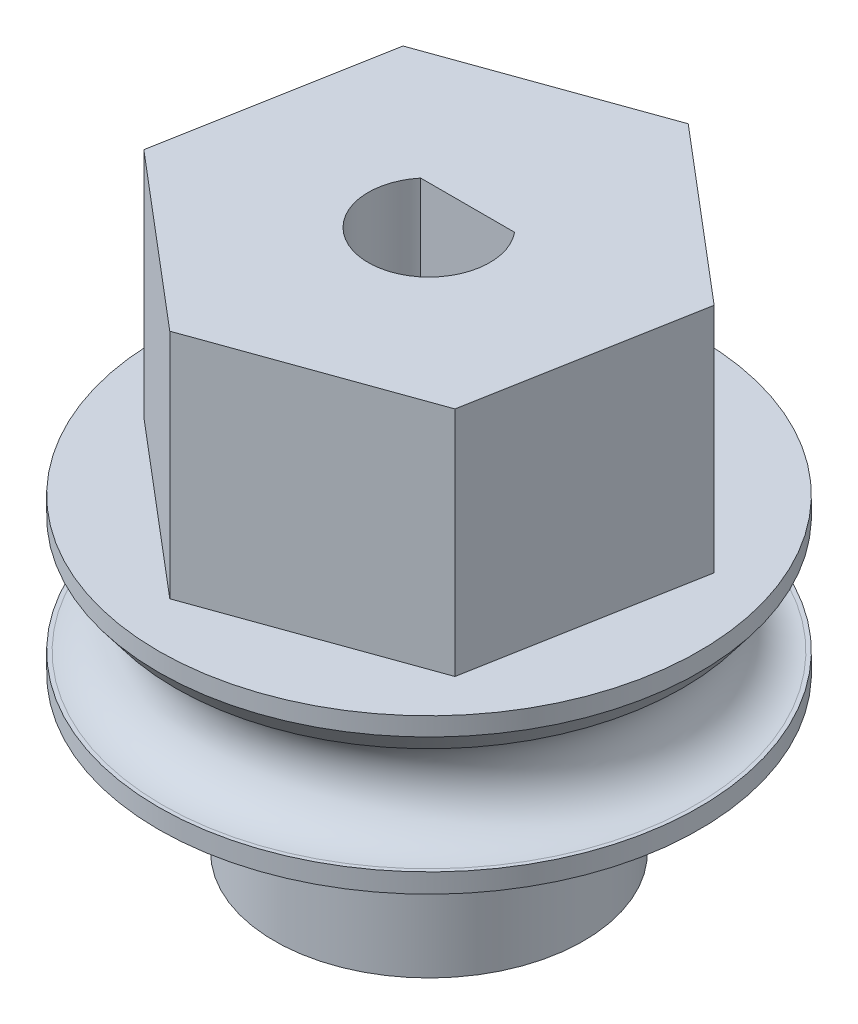
ISO-10303-21;
HEADER;
FILE_DESCRIPTION(('STEP AP214'),'2;1');
FILE_NAME('part.step','',(''),(''),'','','');
FILE_SCHEMA(('AUTOMOTIVE_DESIGN { 1 0 10303 214 1 1 1 1 }'));
ENDSEC;
DATA;
#1=APPLICATION_CONTEXT('core data for automotive mechanical design processes');
#2=APPLICATION_PROTOCOL_DEFINITION('international standard','automotive_design',2000,#1);
#3=PRODUCT_CONTEXT('',#1,'mechanical');
#4=PRODUCT('Part','Part','',(#3));
#5=PRODUCT_RELATED_PRODUCT_CATEGORY('part','',(#4));
#6=PRODUCT_DEFINITION_FORMATION('','',#4);
#7=PRODUCT_DEFINITION_CONTEXT('part definition',#1,'design');
#8=PRODUCT_DEFINITION('design','',#6,#7);
#9=PRODUCT_DEFINITION_SHAPE('','',#8);
#10=(LENGTH_UNIT() NAMED_UNIT(*) SI_UNIT(.MILLI.,.METRE.));
#11=(NAMED_UNIT(*) PLANE_ANGLE_UNIT() SI_UNIT($,.RADIAN.));
#12=(NAMED_UNIT(*) SI_UNIT($,.STERADIAN.) SOLID_ANGLE_UNIT());
#13=UNCERTAINTY_MEASURE_WITH_UNIT(LENGTH_MEASURE(1.E-05),#10,'distance_accuracy_value','');
#14=(GEOMETRIC_REPRESENTATION_CONTEXT(3) GLOBAL_UNCERTAINTY_ASSIGNED_CONTEXT((#13)) GLOBAL_UNIT_ASSIGNED_CONTEXT((#10,
#11,#12)) REPRESENTATION_CONTEXT('',''));
#15=CARTESIAN_POINT('',(0.,0.,0.));
#16=DIRECTION('',(0.,0.,1.));
#17=DIRECTION('',(1.,0.,0.));
#18=AXIS2_PLACEMENT_3D('',#15,#16,#17);
#19=CARTESIAN_POINT('',(0.,7.62,0.));
#20=DIRECTION('',(0.,1.,0.));
#21=DIRECTION('',(0.,0.,1.));
#22=AXIS2_PLACEMENT_3D('',#19,#20,#21);
#23=PLANE('',#22);
#24=DIRECTION('',(0.178441407772219,0.,-0.983950539403413));
#25=VECTOR('',#24,1.);
#26=CARTESIAN_POINT('',(5.59388863815633,7.62,4.74043703019445));
#27=LINE('',#26,#25);
#28=CARTESIAN_POINT('',(5.59388863815633,7.62,4.74043703019445));
#29=VERTEX_POINT('',#28);
#30=CARTESIAN_POINT('',(6.90228321226704,7.62,-2.47423115148727));
#31=VERTEX_POINT('',#30);
#32=EDGE_CURVE('E158',#29,#31,#27,.T.);
#33=ORIENTED_EDGE('',*,*,#32,.T.);
#34=DIRECTION('',(-0.762905459304647,0.,-0.646510061919507));
#35=VECTOR('',#34,1.);
#36=CARTESIAN_POINT('',(6.90228321226704,7.62,-2.47423115148727));
#37=LINE('',#36,#35);
#38=CARTESIAN_POINT('',(1.30839457411072,7.62,-7.21466818168174));
#39=VERTEX_POINT('',#38);
#40=EDGE_CURVE('E162',#31,#39,#37,.T.);
#41=ORIENTED_EDGE('',*,*,#40,.T.);
#42=DIRECTION('',(-0.941346867076868,0.,0.337440477483906));
#43=VECTOR('',#42,1.);
#44=CARTESIAN_POINT('',(1.30839457411072,7.62,-7.21466818168174));
#45=LINE('',#44,#43);
#46=CARTESIAN_POINT('',(-5.59388863815631,7.62,-4.74043703019447));
#47=VERTEX_POINT('',#46);
#48=EDGE_CURVE('E166',#39,#47,#45,.T.);
#49=ORIENTED_EDGE('',*,*,#48,.T.);
#50=DIRECTION('',(-0.178441407772221,0.,0.983950539403413));
#51=VECTOR('',#50,1.);
#52=CARTESIAN_POINT('',(-5.59388863815631,7.62,-4.74043703019447));
#53=LINE('',#52,#51);
#54=CARTESIAN_POINT('',(-6.90228321226703,7.62,2.47423115148727));
#55=VERTEX_POINT('',#54);
#56=EDGE_CURVE('E169',#47,#55,#53,.T.);
#57=ORIENTED_EDGE('',*,*,#56,.T.);
#58=DIRECTION('',(0.762905459304647,0.,0.646510061919508));
#59=VECTOR('',#58,1.);
#60=CARTESIAN_POINT('',(-6.90228321226703,7.62,2.47423115148727));
#61=LINE('',#60,#59);
#62=CARTESIAN_POINT('',(-1.30839457411072,7.62,7.21466818168174));
#63=VERTEX_POINT('',#62);
#64=EDGE_CURVE('E172',#55,#63,#61,.T.);
#65=ORIENTED_EDGE('',*,*,#64,.T.);
#66=DIRECTION('',(0.941346867076867,0.,-0.337440477483907));
#67=VECTOR('',#66,1.);
#68=CARTESIAN_POINT('',(-1.30839457411072,7.62,7.21466818168174));
#69=LINE('',#68,#67);
#70=EDGE_CURVE('E175',#63,#29,#69,.T.);
#71=ORIENTED_EDGE('',*,*,#70,.T.);
#72=EDGE_LOOP('',(#33,#41,#49,#57,#65,#71));
#73=FACE_BOUND('',#72,.T.);
#74=CARTESIAN_POINT('',(0.,7.62,0.));
#75=DIRECTION('',(0.,1.,0.));
#76=DIRECTION('',(0.,0.,1.));
#77=AXIS2_PLACEMENT_3D('',#74,#75,#76);
#78=CIRCLE('',#77,2.000000064);
#79=CARTESIAN_POINT('',(-1.5450243545006,7.62,-1.27));
#80=VERTEX_POINT('',#79);
#81=CARTESIAN_POINT('',(1.5450243545006,7.62,-1.27));
#82=VERTEX_POINT('',#81);
#83=EDGE_CURVE('E119',#80,#82,#78,.T.);
#84=ORIENTED_EDGE('',*,*,#83,.F.);
#85=DIRECTION('',(1.,0.,0.));
#86=VECTOR('',#85,1.);
#87=CARTESIAN_POINT('',(0.,7.62,-1.27));
#88=LINE('',#87,#86);
#89=EDGE_CURVE('E62',#80,#82,#88,.T.);
#90=ORIENTED_EDGE('',*,*,#89,.T.);
#91=EDGE_LOOP('',(#84,#90));
#92=FACE_BOUND('',#91,.T.);
#93=ADVANCED_FACE('F45',(#73,#92),#23,.T.);
#94=CARTESIAN_POINT('',(0.,-10.16,5.08));
#95=DIRECTION('',(0.,1.,0.));
#96=DIRECTION('',(0.,0.,1.));
#97=AXIS2_PLACEMENT_3D('',#94,#95,#96);
#98=PLANE('',#97);
#99=CARTESIAN_POINT('',(0.,-10.16,0.));
#100=DIRECTION('',(0.,-1.,0.));
#101=DIRECTION('',(0.,0.,-1.));
#102=AXIS2_PLACEMENT_3D('',#99,#100,#101);
#103=CIRCLE('',#102,5.08);
#104=CARTESIAN_POINT('',(0.,-10.16,-5.08));
#105=VERTEX_POINT('',#104);
#106=EDGE_CURVE('E153',#105,#105,#103,.T.);
#107=ORIENTED_EDGE('',*,*,#106,.T.);
#108=EDGE_LOOP('',(#107));
#109=FACE_BOUND('',#108,.T.);
#110=DIRECTION('',(1.,0.,0.));
#111=VECTOR('',#110,1.);
#112=CARTESIAN_POINT('',(0.,-10.16,-1.27));
#113=LINE('',#112,#111);
#114=CARTESIAN_POINT('',(-1.5450243545006,-10.16,-1.27));
#115=VERTEX_POINT('',#114);
#116=CARTESIAN_POINT('',(1.5450243545006,-10.16,-1.27));
#117=VERTEX_POINT('',#116);
#118=EDGE_CURVE('E112',#115,#117,#113,.T.);
#119=ORIENTED_EDGE('',*,*,#118,.F.);
#120=CARTESIAN_POINT('',(0.,-10.16,0.));
#121=DIRECTION('',(0.,1.,0.));
#122=DIRECTION('',(0.,0.,1.));
#123=AXIS2_PLACEMENT_3D('',#120,#121,#122);
#124=CIRCLE('',#123,2.000000064);
#125=EDGE_CURVE('E129',#115,#117,#124,.T.);
#126=ORIENTED_EDGE('',*,*,#125,.T.);
#127=EDGE_LOOP('',(#119,#126));
#128=FACE_BOUND('',#127,.T.);
#129=ADVANCED_FACE('F242',(#109,#128),#98,.F.);
#130=CARTESIAN_POINT('',(5.59388863815633,7.62,4.74043703019445));
#131=DIRECTION('',(-0.983950539403414,0.,-0.178441407772219));
#132=DIRECTION('',(-0.178441407772219,0.,0.983950539403414));
#133=AXIS2_PLACEMENT_3D('',#130,#131,#132);
#134=PLANE('',#133);
#135=DIRECTION('',(0.178441407772219,0.,-0.983950539403413));
#136=VECTOR('',#135,1.);
#137=CARTESIAN_POINT('',(5.59388863815633,0.,4.74043703019445));
#138=LINE('',#137,#136);
#139=CARTESIAN_POINT('',(5.59388863815633,0.,4.74043703019445));
#140=VERTEX_POINT('',#139);
#141=CARTESIAN_POINT('',(6.90228321226704,0.,-2.47423115148727));
#142=VERTEX_POINT('',#141);
#143=EDGE_CURVE('E157',#140,#142,#138,.T.);
#144=ORIENTED_EDGE('',*,*,#143,.T.);
#145=DIRECTION('',(0.,-1.,0.));
#146=VECTOR('',#145,1.);
#147=CARTESIAN_POINT('',(6.90228321226704,7.62,-2.47423115148727));
#148=LINE('',#147,#146);
#149=EDGE_CURVE('E220',#31,#142,#148,.T.);
#150=ORIENTED_EDGE('',*,*,#149,.F.);
#151=ORIENTED_EDGE('',*,*,#32,.F.);
#152=DIRECTION('',(0.,-1.,0.));
#153=VECTOR('',#152,1.);
#154=CARTESIAN_POINT('',(5.59388863815633,7.62,4.74043703019445));
#155=LINE('',#154,#153);
#156=EDGE_CURVE('E178',#29,#140,#155,.T.);
#157=ORIENTED_EDGE('',*,*,#156,.T.);
#158=EDGE_LOOP('',(#144,#150,#151,#157));
#159=FACE_BOUND('',#158,.T.);
#160=ADVANCED_FACE('F248',(#159),#134,.F.);
#161=CARTESIAN_POINT('',(6.90228321226704,7.62,-2.47423115148727));
#162=DIRECTION('',(-0.646510061919507,0.,0.762905459304647));
#163=DIRECTION('',(0.762905459304647,0.,0.646510061919507));
#164=AXIS2_PLACEMENT_3D('',#161,#162,#163);
#165=PLANE('',#164);
#166=DIRECTION('',(-0.762905459304647,0.,-0.646510061919507));
#167=VECTOR('',#166,1.);
#168=CARTESIAN_POINT('',(6.90228321226704,0.,-2.47423115148727));
#169=LINE('',#168,#167);
#170=CARTESIAN_POINT('',(1.30839457411072,0.,-7.21466818168174));
#171=VERTEX_POINT('',#170);
#172=EDGE_CURVE('E182',#142,#171,#169,.T.);
#173=ORIENTED_EDGE('',*,*,#172,.T.);
#174=DIRECTION('',(0.,-1.,0.));
#175=VECTOR('',#174,1.);
#176=CARTESIAN_POINT('',(1.30839457411072,7.62,-7.21466818168174));
#177=LINE('',#176,#175);
#178=EDGE_CURVE('E216',#39,#171,#177,.T.);
#179=ORIENTED_EDGE('',*,*,#178,.F.);
#180=ORIENTED_EDGE('',*,*,#40,.F.);
#181=ORIENTED_EDGE('',*,*,#149,.T.);
#182=EDGE_LOOP('',(#173,#179,#180,#181));
#183=FACE_BOUND('',#182,.T.);
#184=ADVANCED_FACE('F269',(#183),#165,.F.);
#185=CARTESIAN_POINT('',(1.30839457411072,7.62,-7.21466818168174));
#186=DIRECTION('',(0.337440477483905,0.,0.941346867076868));
#187=DIRECTION('',(0.941346867076868,0.,-0.337440477483906));
#188=AXIS2_PLACEMENT_3D('',#185,#186,#187);
#189=PLANE('',#188);
#190=DIRECTION('',(-0.941346867076868,0.,0.337440477483906));
#191=VECTOR('',#190,1.);
#192=CARTESIAN_POINT('',(1.30839457411072,0.,-7.21466818168174));
#193=LINE('',#192,#191);
#194=CARTESIAN_POINT('',(-5.59388863815631,0.,-4.74043703019447));
#195=VERTEX_POINT('',#194);
#196=EDGE_CURVE('E186',#171,#195,#193,.T.);
#197=ORIENTED_EDGE('',*,*,#196,.T.);
#198=DIRECTION('',(0.,-1.,0.));
#199=VECTOR('',#198,1.);
#200=CARTESIAN_POINT('',(-5.59388863815631,7.62,-4.74043703019447));
#201=LINE('',#200,#199);
#202=EDGE_CURVE('E212',#47,#195,#201,.T.);
#203=ORIENTED_EDGE('',*,*,#202,.F.);
#204=ORIENTED_EDGE('',*,*,#48,.F.);
#205=ORIENTED_EDGE('',*,*,#178,.T.);
#206=EDGE_LOOP('',(#197,#203,#204,#205));
#207=FACE_BOUND('',#206,.T.);
#208=ADVANCED_FACE('F265',(#207),#189,.F.);
#209=CARTESIAN_POINT('',(-5.59388863815631,7.62,-4.74043703019447));
#210=DIRECTION('',(0.983950539403413,0.,0.178441407772221));
#211=DIRECTION('',(0.178441407772221,0.,-0.983950539403413));
#212=AXIS2_PLACEMENT_3D('',#209,#210,#211);
#213=PLANE('',#212);
#214=DIRECTION('',(-0.178441407772221,0.,0.983950539403413));
#215=VECTOR('',#214,1.);
#216=CARTESIAN_POINT('',(-5.59388863815631,0.,-4.74043703019447));
#217=LINE('',#216,#215);
#218=CARTESIAN_POINT('',(-6.90228321226703,0.,2.47423115148727));
#219=VERTEX_POINT('',#218);
#220=EDGE_CURVE('E190',#195,#219,#217,.T.);
#221=ORIENTED_EDGE('',*,*,#220,.T.);
#222=DIRECTION('',(0.,-1.,0.));
#223=VECTOR('',#222,1.);
#224=CARTESIAN_POINT('',(-6.90228321226703,7.62,2.47423115148727));
#225=LINE('',#224,#223);
#226=EDGE_CURVE('E208',#55,#219,#225,.T.);
#227=ORIENTED_EDGE('',*,*,#226,.F.);
#228=ORIENTED_EDGE('',*,*,#56,.F.);
#229=ORIENTED_EDGE('',*,*,#202,.T.);
#230=EDGE_LOOP('',(#221,#227,#228,#229));
#231=FACE_BOUND('',#230,.T.);
#232=ADVANCED_FACE('F261',(#231),#213,.F.);
#233=CARTESIAN_POINT('',(-6.90228321226703,7.62,2.47423115148727));
#234=DIRECTION('',(0.646510061919508,0.,-0.762905459304647));
#235=DIRECTION('',(-0.762905459304647,0.,-0.646510061919508));
#236=AXIS2_PLACEMENT_3D('',#233,#234,#235);
#237=PLANE('',#236);
#238=DIRECTION('',(0.762905459304647,0.,0.646510061919508));
#239=VECTOR('',#238,1.);
#240=CARTESIAN_POINT('',(-6.90228321226703,0.,2.47423115148727));
#241=LINE('',#240,#239);
#242=CARTESIAN_POINT('',(-1.30839457411072,0.,7.21466818168174));
#243=VERTEX_POINT('',#242);
#244=EDGE_CURVE('E194',#219,#243,#241,.T.);
#245=ORIENTED_EDGE('',*,*,#244,.T.);
#246=DIRECTION('',(0.,-1.,0.));
#247=VECTOR('',#246,1.);
#248=CARTESIAN_POINT('',(-1.30839457411072,7.62,7.21466818168174));
#249=LINE('',#248,#247);
#250=EDGE_CURVE('E204',#63,#243,#249,.T.);
#251=ORIENTED_EDGE('',*,*,#250,.F.);
#252=ORIENTED_EDGE('',*,*,#64,.F.);
#253=ORIENTED_EDGE('',*,*,#226,.T.);
#254=EDGE_LOOP('',(#245,#251,#252,#253));
#255=FACE_BOUND('',#254,.T.);
#256=ADVANCED_FACE('F257',(#255),#237,.F.);
#257=CARTESIAN_POINT('',(-1.30839457411072,7.62,7.21466818168174));
#258=DIRECTION('',(-0.337440477483907,0.,-0.941346867076867));
#259=DIRECTION('',(-0.941346867076867,0.,0.337440477483907));
#260=AXIS2_PLACEMENT_3D('',#257,#258,#259);
#261=PLANE('',#260);
#262=DIRECTION('',(0.941346867076867,0.,-0.337440477483907));
#263=VECTOR('',#262,1.);
#264=CARTESIAN_POINT('',(-1.30839457411072,0.,7.21466818168174));
#265=LINE('',#264,#263);
#266=EDGE_CURVE('E163',#243,#140,#265,.T.);
#267=ORIENTED_EDGE('',*,*,#266,.T.);
#268=ORIENTED_EDGE('',*,*,#156,.F.);
#269=ORIENTED_EDGE('',*,*,#70,.F.);
#270=ORIENTED_EDGE('',*,*,#250,.T.);
#271=EDGE_LOOP('',(#267,#268,#269,#270));
#272=FACE_BOUND('',#271,.T.);
#273=ADVANCED_FACE('F254',(#272),#261,.F.);
#274=CARTESIAN_POINT('',(0.,0.,0.));
#275=DIRECTION('',(0.,-1.,0.));
#276=DIRECTION('',(0.,0.,-1.));
#277=AXIS2_PLACEMENT_3D('',#274,#275,#276);
#278=PLANE('',#277);
#279=ORIENTED_EDGE('',*,*,#143,.F.);
#280=ORIENTED_EDGE('',*,*,#266,.F.);
#281=ORIENTED_EDGE('',*,*,#244,.F.);
#282=ORIENTED_EDGE('',*,*,#220,.F.);
#283=ORIENTED_EDGE('',*,*,#196,.F.);
#284=ORIENTED_EDGE('',*,*,#172,.F.);
#285=EDGE_LOOP('',(#279,#280,#281,#282,#283,#284));
#286=FACE_BOUND('',#285,.T.);
#287=CARTESIAN_POINT('',(0.,0.,0.));
#288=DIRECTION('',(0.,-1.,0.));
#289=DIRECTION('',(0.,0.,-1.));
#290=AXIS2_PLACEMENT_3D('',#287,#288,#289);
#291=CIRCLE('',#290,8.89);
#292=CARTESIAN_POINT('',(0.,0.,-8.89));
#293=VERTEX_POINT('',#292);
#294=EDGE_CURVE('E115',#293,#293,#291,.T.);
#295=ORIENTED_EDGE('',*,*,#294,.F.);
#296=EDGE_LOOP('',(#295));
#297=FACE_BOUND('',#296,.T.);
#298=ADVANCED_FACE('F253',(#286,#297),#278,.F.);
#299=CARTESIAN_POINT('',(0.,0.,0.));
#300=DIRECTION('',(0.,-1.,0.));
#301=DIRECTION('',(0.,0.,-1.));
#302=AXIS2_PLACEMENT_3D('',#299,#300,#301);
#303=CYLINDRICAL_SURFACE('',#302,5.08);
#304=ORIENTED_EDGE('',*,*,#106,.F.);
#305=EDGE_LOOP('',(#304));
#306=FACE_BOUND('',#305,.T.);
#307=CARTESIAN_POINT('',(0.,-5.08,0.));
#308=DIRECTION('',(0.,-1.,0.));
#309=DIRECTION('',(0.,0.,-1.));
#310=AXIS2_PLACEMENT_3D('',#307,#308,#309);
#311=CIRCLE('',#310,5.08);
#312=CARTESIAN_POINT('',(0.,-5.08,-5.08));
#313=VERTEX_POINT('',#312);
#314=EDGE_CURVE('E149',#313,#313,#311,.T.);
#315=ORIENTED_EDGE('',*,*,#314,.T.);
#316=EDGE_LOOP('',(#315));
#317=FACE_BOUND('',#316,.T.);
#318=ADVANCED_FACE('F291',(#306,#317),#303,.T.);
#319=CARTESIAN_POINT('',(0.,-5.08,8.89));
#320=DIRECTION('',(0.,1.,0.));
#321=DIRECTION('',(0.,0.,1.));
#322=AXIS2_PLACEMENT_3D('',#319,#320,#321);
#323=PLANE('',#322);
#324=ORIENTED_EDGE('',*,*,#314,.F.);
#325=EDGE_LOOP('',(#324));
#326=FACE_BOUND('',#325,.T.);
#327=CARTESIAN_POINT('',(0.,-5.08,0.));
#328=DIRECTION('',(0.,-1.,0.));
#329=DIRECTION('',(0.,0.,-1.));
#330=AXIS2_PLACEMENT_3D('',#327,#328,#329);
#331=CIRCLE('',#330,8.89);
#332=CARTESIAN_POINT('',(0.,-5.08,-8.89));
#333=VERTEX_POINT('',#332);
#334=EDGE_CURVE('E145',#333,#333,#331,.T.);
#335=ORIENTED_EDGE('',*,*,#334,.T.);
#336=EDGE_LOOP('',(#335));
#337=FACE_BOUND('',#336,.T.);
#338=ADVANCED_FACE('F297',(#326,#337),#323,.F.);
#339=CARTESIAN_POINT('',(0.,0.,0.));
#340=DIRECTION('',(0.,-1.,0.));
#341=DIRECTION('',(0.,0.,-1.));
#342=AXIS2_PLACEMENT_3D('',#339,#340,#341);
#343=CYLINDRICAL_SURFACE('',#342,8.89);
#344=ORIENTED_EDGE('',*,*,#334,.F.);
#345=EDGE_LOOP('',(#344));
#346=FACE_BOUND('',#345,.T.);
#347=CARTESIAN_POINT('',(0.,-4.445,0.));
#348=DIRECTION('',(0.,-1.,0.));
#349=DIRECTION('',(0.,0.,-1.));
#350=AXIS2_PLACEMENT_3D('',#347,#348,#349);
#351=CIRCLE('',#350,8.89);
#352=CARTESIAN_POINT('',(0.,-4.445,-8.89));
#353=VERTEX_POINT('',#352);
#354=EDGE_CURVE('E141',#353,#353,#351,.T.);
#355=ORIENTED_EDGE('',*,*,#354,.T.);
#356=EDGE_LOOP('',(#355));
#357=FACE_BOUND('',#356,.T.);
#358=ADVANCED_FACE('F303',(#346,#357),#343,.T.);
#359=CARTESIAN_POINT('',(0.,-4.445,8.763));
#360=DIRECTION('',(0.,-1.,0.));
#361=DIRECTION('',(0.,0.,-1.));
#362=AXIS2_PLACEMENT_3D('',#359,#360,#361);
#363=PLANE('',#362);
#364=ORIENTED_EDGE('',*,*,#354,.F.);
#365=EDGE_LOOP('',(#364));
#366=FACE_BOUND('',#365,.T.);
#367=CARTESIAN_POINT('',(0.,-4.445,0.));
#368=DIRECTION('',(0.,-1.,0.));
#369=DIRECTION('',(0.,0.,-1.));
#370=AXIS2_PLACEMENT_3D('',#367,#368,#369);
#371=CIRCLE('',#370,8.763);
#372=CARTESIAN_POINT('',(0.,-4.445,-8.763));
#373=VERTEX_POINT('',#372);
#374=EDGE_CURVE('E137',#373,#373,#371,.T.);
#375=ORIENTED_EDGE('',*,*,#374,.T.);
#376=EDGE_LOOP('',(#375));
#377=FACE_BOUND('',#376,.T.);
#378=ADVANCED_FACE('F311',(#366,#377),#363,.F.);
#379=CARTESIAN_POINT('',(0.,-2.8575,0.));
#380=DIRECTION('',(0.,-1.,0.));
#381=DIRECTION('',(0.,0.,-1.));
#382=AXIS2_PLACEMENT_3D('',#379,#380,#381);
#383=TOROIDAL_SURFACE('',#382,8.763,1.5875);
#384=CARTESIAN_POINT('',(0.,-1.3274226302968,0.));
#385=DIRECTION('',(0.,-1.,0.));
#386=DIRECTION('',(0.,0.,-1.));
#387=AXIS2_PLACEMENT_3D('',#384,#385,#386);
#388=CIRCLE('',#387,8.33989304812833);
#389=CARTESIAN_POINT('',(0.,-1.3274226302968,-8.33989304812833));
#390=VERTEX_POINT('',#389);
#391=EDGE_CURVE('E55',#390,#390,#388,.T.);
#392=ORIENTED_EDGE('',*,*,#391,.T.);
#393=EDGE_LOOP('',(#392));
#394=FACE_BOUND('',#393,.T.);
#395=ORIENTED_EDGE('',*,*,#374,.F.);
#396=EDGE_LOOP('',(#395));
#397=FACE_BOUND('',#396,.T.);
#398=ADVANCED_FACE('F227',(#394,#397),#383,.F.);
#399=CARTESIAN_POINT('',(0.,0.,0.));
#400=DIRECTION('',(0.,-1.,0.));
#401=DIRECTION('',(0.,0.,-1.));
#402=AXIS2_PLACEMENT_3D('',#399,#400,#401);
#403=CYLINDRICAL_SURFACE('',#402,8.89);
#404=CARTESIAN_POINT('',(0.,-0.604551432011814,0.));
#405=DIRECTION('',(0.,1.,0.));
#406=DIRECTION('',(0.,0.,1.));
#407=AXIS2_PLACEMENT_3D('',#404,#405,#406);
#408=CIRCLE('',#407,8.89);
#409=CARTESIAN_POINT('',(0.,-0.604551432011814,8.89));
#410=VERTEX_POINT('',#409);
#411=EDGE_CURVE('E11',#410,#410,#408,.T.);
#412=ORIENTED_EDGE('',*,*,#411,.T.);
#413=EDGE_LOOP('',(#412));
#414=FACE_BOUND('',#413,.T.);
#415=ORIENTED_EDGE('',*,*,#294,.T.);
#416=EDGE_LOOP('',(#415));
#417=FACE_BOUND('',#416,.T.);
#418=ADVANCED_FACE('F231',(#414,#417),#403,.T.);
#419=CARTESIAN_POINT('',(0.,-1.3274226302968,0.));
#420=DIRECTION('',(0.,1.,0.));
#421=DIRECTION('',(0.,0.,1.));
#422=AXIS2_PLACEMENT_3D('',#419,#420,#421);
#423=CONICAL_SURFACE('',#422,8.33989304812833,0.650505744123328);
#424=ORIENTED_EDGE('',*,*,#411,.F.);
#425=EDGE_LOOP('',(#424));
#426=FACE_BOUND('',#425,.T.);
#427=ORIENTED_EDGE('',*,*,#391,.F.);
#428=EDGE_LOOP('',(#427));
#429=FACE_BOUND('',#428,.T.);
#430=ADVANCED_FACE('F48',(#426,#429),#423,.T.);
#431=CARTESIAN_POINT('',(0.,-10.16,-1.27));
#432=DIRECTION('',(0.,0.,1.));
#433=DIRECTION('',(1.,0.,0.));
#434=AXIS2_PLACEMENT_3D('',#431,#432,#433);
#435=PLANE('',#434);
#436=DIRECTION('',(0.,1.,0.));
#437=VECTOR('',#436,1.);
#438=CARTESIAN_POINT('',(-1.5450243545006,-10.16,-1.27));
#439=LINE('',#438,#437);
#440=EDGE_CURVE('E116',#115,#80,#439,.T.);
#441=ORIENTED_EDGE('',*,*,#440,.F.);
#442=ORIENTED_EDGE('',*,*,#118,.T.);
#443=DIRECTION('',(0.,1.,0.));
#444=VECTOR('',#443,1.);
#445=CARTESIAN_POINT('',(1.5450243545006,-10.16,-1.27));
#446=LINE('',#445,#444);
#447=EDGE_CURVE('E69',#117,#82,#446,.T.);
#448=ORIENTED_EDGE('',*,*,#447,.T.);
#449=ORIENTED_EDGE('',*,*,#89,.F.);
#450=EDGE_LOOP('',(#441,#442,#448,#449));
#451=FACE_BOUND('',#450,.T.);
#452=ADVANCED_FACE('F110',(#451),#435,.T.);
#453=CARTESIAN_POINT('',(0.,-10.16,0.));
#454=DIRECTION('',(0.,1.,0.));
#455=DIRECTION('',(0.,0.,1.));
#456=AXIS2_PLACEMENT_3D('',#453,#454,#455);
#457=CYLINDRICAL_SURFACE('',#456,2.000000064);
#458=ORIENTED_EDGE('',*,*,#447,.F.);
#459=ORIENTED_EDGE('',*,*,#125,.F.);
#460=ORIENTED_EDGE('',*,*,#440,.T.);
#461=ORIENTED_EDGE('',*,*,#83,.T.);
#462=EDGE_LOOP('',(#458,#459,#460,#461));
#463=FACE_BOUND('',#462,.T.);
#464=ADVANCED_FACE('F120',(#463),#457,.F.);
#465=CLOSED_SHELL('',(#93,#129,#160,#184,#208,#232,#256,#273,#298,#318,#338,#358,#378,#398,#418,
#430,#452,#464));
#466=MANIFOLD_SOLID_BREP('B2',#465);
#467=ADVANCED_BREP_SHAPE_REPRESENTATION('',(#18,#466),#14);
#468=SHAPE_DEFINITION_REPRESENTATION(#9,#467);
ENDSEC;
END-ISO-10303-21;
